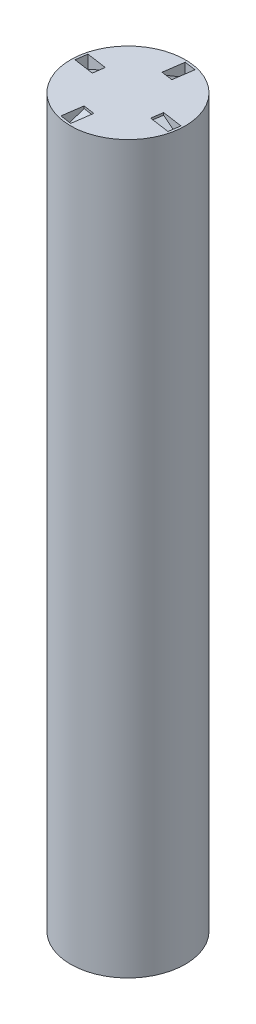
ISO-10303-21;
HEADER;
FILE_DESCRIPTION(('STEP AP214'),'2;1');
FILE_NAME('part.step','',(''),(''),'','','');
FILE_SCHEMA(('AUTOMOTIVE_DESIGN { 1 0 10303 214 1 1 1 1 }'));
ENDSEC;
DATA;
#1=APPLICATION_CONTEXT('core data for automotive mechanical design processes');
#2=APPLICATION_PROTOCOL_DEFINITION('international standard','automotive_design',2000,#1);
#3=PRODUCT_CONTEXT('',#1,'mechanical');
#4=PRODUCT('Part','Part','',(#3));
#5=PRODUCT_RELATED_PRODUCT_CATEGORY('part','',(#4));
#6=PRODUCT_DEFINITION_FORMATION('','',#4);
#7=PRODUCT_DEFINITION_CONTEXT('part definition',#1,'design');
#8=PRODUCT_DEFINITION('design','',#6,#7);
#9=PRODUCT_DEFINITION_SHAPE('','',#8);
#10=(LENGTH_UNIT() NAMED_UNIT(*) SI_UNIT(.MILLI.,.METRE.));
#11=(NAMED_UNIT(*) PLANE_ANGLE_UNIT() SI_UNIT($,.RADIAN.));
#12=(NAMED_UNIT(*) SI_UNIT($,.STERADIAN.) SOLID_ANGLE_UNIT());
#13=UNCERTAINTY_MEASURE_WITH_UNIT(LENGTH_MEASURE(1.E-05),#10,'distance_accuracy_value','');
#14=(GEOMETRIC_REPRESENTATION_CONTEXT(3) GLOBAL_UNCERTAINTY_ASSIGNED_CONTEXT((#13)) GLOBAL_UNIT_ASSIGNED_CONTEXT((#10,
#11,#12)) REPRESENTATION_CONTEXT('',''));
#15=CARTESIAN_POINT('',(0.,0.,0.));
#16=DIRECTION('',(0.,0.,1.));
#17=DIRECTION('',(1.,0.,0.));
#18=AXIS2_PLACEMENT_3D('',#15,#16,#17);
#19=CARTESIAN_POINT('',(0.,80.99,0.));
#20=DIRECTION('',(0.,1.,0.));
#21=DIRECTION('',(0.,0.,1.));
#22=AXIS2_PLACEMENT_3D('',#19,#20,#21);
#23=PLANE('',#22);
#24=DIRECTION('',(0.142609317523363,0.,-0.989779057444398));
#25=VECTOR('',#24,1.);
#26=CARTESIAN_POINT('',(5.96715954111172,80.99,1.50636906135462));
#27=LINE('',#26,#25);
#28=CARTESIAN_POINT('',(5.96715954111172,80.99,1.50636906135462));
#29=VERTEX_POINT('',#28);
#30=CARTESIAN_POINT('',(6.14969946754163,80.99,0.239451867825787));
#31=VERTEX_POINT('',#30);
#32=EDGE_CURVE('E249',#29,#31,#27,.T.);
#33=ORIENTED_EDGE('',*,*,#32,.F.);
#34=DIRECTION('',(0.989779057444398,0.,0.142609317523363));
#35=VECTOR('',#34,1.);
#36=CARTESIAN_POINT('',(3.7104632901385,80.99,1.18121981740135));
#37=LINE('',#36,#35);
#38=CARTESIAN_POINT('',(3.7104632901385,80.99,1.18121981740135));
#39=VERTEX_POINT('',#38);
#40=EDGE_CURVE('E225',#39,#29,#37,.T.);
#41=ORIENTED_EDGE('',*,*,#40,.F.);
#42=DIRECTION('',(0.142609317523363,0.,-0.989779057444398));
#43=VECTOR('',#42,1.);
#44=CARTESIAN_POINT('',(3.7104632901385,80.99,1.18121981740135));
#45=LINE('',#44,#43);
#46=CARTESIAN_POINT('',(3.8930032165684,80.99,-0.0856973761274811));
#47=VERTEX_POINT('',#46);
#48=EDGE_CURVE('E235',#39,#47,#45,.T.);
#49=ORIENTED_EDGE('',*,*,#48,.T.);
#50=DIRECTION('',(0.989779057444398,0.,0.142609317523363));
#51=VECTOR('',#50,1.);
#52=CARTESIAN_POINT('',(3.8930032165684,80.99,-0.0856973761274811));
#53=LINE('',#52,#51);
#54=EDGE_CURVE('E238',#47,#31,#53,.T.);
#55=ORIENTED_EDGE('',*,*,#54,.T.);
#56=EDGE_LOOP('',(#33,#41,#49,#55));
#57=FACE_BOUND('',#56,.T.);
#58=DIRECTION('',(-0.142609317523363,0.,0.989779057444398));
#59=VECTOR('',#58,1.);
#60=CARTESIAN_POINT('',(-5.96715954111172,80.99,-1.50636906135462));
#61=LINE('',#60,#59);
#62=CARTESIAN_POINT('',(-5.96715954111172,80.99,-1.50636906135462));
#63=VERTEX_POINT('',#62);
#64=CARTESIAN_POINT('',(-6.14969946754163,80.99,-0.239451867825787));
#65=VERTEX_POINT('',#64);
#66=EDGE_CURVE('E316',#63,#65,#61,.T.);
#67=ORIENTED_EDGE('',*,*,#66,.F.);
#68=DIRECTION('',(-0.989779057444398,0.,-0.142609317523363));
#69=VECTOR('',#68,1.);
#70=CARTESIAN_POINT('',(-3.7104632901385,80.99,-1.18121981740135));
#71=LINE('',#70,#69);
#72=CARTESIAN_POINT('',(-3.7104632901385,80.99,-1.18121981740135));
#73=VERTEX_POINT('',#72);
#74=EDGE_CURVE('E290',#73,#63,#71,.T.);
#75=ORIENTED_EDGE('',*,*,#74,.F.);
#76=DIRECTION('',(-0.142609317523363,0.,0.989779057444398));
#77=VECTOR('',#76,1.);
#78=CARTESIAN_POINT('',(-3.7104632901385,80.99,-1.18121981740135));
#79=LINE('',#78,#77);
#80=CARTESIAN_POINT('',(-3.8930032165684,80.99,0.0856973761274811));
#81=VERTEX_POINT('',#80);
#82=EDGE_CURVE('E300',#73,#81,#79,.T.);
#83=ORIENTED_EDGE('',*,*,#82,.T.);
#84=DIRECTION('',(-0.989779057444398,0.,-0.142609317523363));
#85=VECTOR('',#84,1.);
#86=CARTESIAN_POINT('',(-3.8930032165684,80.99,0.0856973761274811));
#87=LINE('',#86,#85);
#88=EDGE_CURVE('E303',#81,#65,#87,.T.);
#89=ORIENTED_EDGE('',*,*,#88,.T.);
#90=EDGE_LOOP('',(#67,#75,#83,#89));
#91=FACE_BOUND('',#90,.T.);
#92=CARTESIAN_POINT('',(0.,80.99,0.));
#93=DIRECTION('',(0.,1.,0.));
#94=DIRECTION('',(0.,0.,1.));
#95=AXIS2_PLACEMENT_3D('',#92,#93,#94);
#96=CIRCLE('',#95,6.395);
#97=CARTESIAN_POINT('',(0.,80.99,6.395));
#98=VERTEX_POINT('',#97);
#99=EDGE_CURVE('E11',#98,#98,#96,.T.);
#100=ORIENTED_EDGE('',*,*,#99,.T.);
#101=EDGE_LOOP('',(#100));
#102=FACE_BOUND('',#101,.T.);
#103=DIRECTION('',(0.989779057444398,0.,0.14260931752336));
#104=VECTOR('',#103,1.);
#105=CARTESIAN_POINT('',(-1.5063690613546,80.99,5.96715954111173));
#106=LINE('',#105,#104);
#107=CARTESIAN_POINT('',(-1.5063690613546,80.99,5.96715954111173));
#108=VERTEX_POINT('',#107);
#109=CARTESIAN_POINT('',(-0.239451867825765,80.99,6.14969946754163));
#110=VERTEX_POINT('',#109);
#111=EDGE_CURVE('E282',#108,#110,#106,.T.);
#112=ORIENTED_EDGE('',*,*,#111,.F.);
#113=DIRECTION('',(-0.14260931752336,0.,0.989779057444398));
#114=VECTOR('',#113,1.);
#115=CARTESIAN_POINT('',(-1.18121981740134,80.99,3.7104632901385));
#116=LINE('',#115,#114);
#117=CARTESIAN_POINT('',(-1.18121981740134,80.99,3.7104632901385));
#118=VERTEX_POINT('',#117);
#119=EDGE_CURVE('E256',#118,#108,#116,.T.);
#120=ORIENTED_EDGE('',*,*,#119,.F.);
#121=DIRECTION('',(0.989779057444398,0.,0.14260931752336));
#122=VECTOR('',#121,1.);
#123=CARTESIAN_POINT('',(-1.18121981740134,80.99,3.7104632901385));
#124=LINE('',#123,#122);
#125=CARTESIAN_POINT('',(0.0856973761274947,80.99,3.8930032165684));
#126=VERTEX_POINT('',#125);
#127=EDGE_CURVE('E266',#118,#126,#124,.T.);
#128=ORIENTED_EDGE('',*,*,#127,.T.);
#129=DIRECTION('',(-0.14260931752336,0.,0.989779057444398));
#130=VECTOR('',#129,1.);
#131=CARTESIAN_POINT('',(0.0856973761274947,80.99,3.8930032165684));
#132=LINE('',#131,#130);
#133=EDGE_CURVE('E269',#126,#110,#132,.T.);
#134=ORIENTED_EDGE('',*,*,#133,.T.);
#135=EDGE_LOOP('',(#112,#120,#128,#134));
#136=FACE_BOUND('',#135,.T.);
#137=DIRECTION('',(-0.989779057444399,0.,-0.142609317523353));
#138=VECTOR('',#137,1.);
#139=CARTESIAN_POINT('',(1.50636906135455,80.99,-5.96715954111174));
#140=LINE('',#139,#138);
#141=CARTESIAN_POINT('',(1.50636906135455,80.99,-5.96715954111174));
#142=VERTEX_POINT('',#141);
#143=CARTESIAN_POINT('',(0.239451867825722,80.99,-6.14969946754163));
#144=VERTEX_POINT('',#143);
#145=EDGE_CURVE('E193',#142,#144,#140,.T.);
#146=ORIENTED_EDGE('',*,*,#145,.F.);
#147=DIRECTION('',(0.142609317523353,0.,-0.989779057444399));
#148=VECTOR('',#147,1.);
#149=CARTESIAN_POINT('',(1.18121981740131,80.99,-3.71046329013851));
#150=LINE('',#149,#148);
#151=CARTESIAN_POINT('',(1.18121981740131,80.99,-3.71046329013851));
#152=VERTEX_POINT('',#151);
#153=EDGE_CURVE('E200',#152,#142,#150,.T.);
#154=ORIENTED_EDGE('',*,*,#153,.F.);
#155=DIRECTION('',(-0.989779057444399,0.,-0.142609317523353));
#156=VECTOR('',#155,1.);
#157=CARTESIAN_POINT('',(1.18121981740131,80.99,-3.71046329013851));
#158=LINE('',#157,#156);
#159=CARTESIAN_POINT('',(-0.0856973761275219,80.99,-3.8930032165684));
#160=VERTEX_POINT('',#159);
#161=EDGE_CURVE('E183',#152,#160,#158,.T.);
#162=ORIENTED_EDGE('',*,*,#161,.T.);
#163=DIRECTION('',(0.142609317523353,0.,-0.989779057444399));
#164=VECTOR('',#163,1.);
#165=CARTESIAN_POINT('',(-0.0856973761275219,80.99,-3.8930032165684));
#166=LINE('',#165,#164);
#167=EDGE_CURVE('E211',#160,#144,#166,.T.);
#168=ORIENTED_EDGE('',*,*,#167,.T.);
#169=EDGE_LOOP('',(#146,#154,#162,#168));
#170=FACE_BOUND('',#169,.T.);
#171=ADVANCED_FACE('F43',(#57,#91,#102,#136,#170),#23,.T.);
#172=CARTESIAN_POINT('',(0.,80.99,0.));
#173=DIRECTION('',(0.,-1.,0.));
#174=DIRECTION('',(0.,0.,-1.));
#175=AXIS2_PLACEMENT_3D('',#172,#173,#174);
#176=CYLINDRICAL_SURFACE('',#175,6.395);
#177=ORIENTED_EDGE('',*,*,#99,.F.);
#178=EDGE_LOOP('',(#177));
#179=FACE_BOUND('',#178,.T.);
#180=CARTESIAN_POINT('',(0.,0.,0.));
#181=DIRECTION('',(0.,1.,0.));
#182=DIRECTION('',(0.,0.,1.));
#183=AXIS2_PLACEMENT_3D('',#180,#181,#182);
#184=CIRCLE('',#183,6.395);
#185=CARTESIAN_POINT('',(0.,0.,6.395));
#186=VERTEX_POINT('',#185);
#187=EDGE_CURVE('E47',#186,#186,#184,.T.);
#188=ORIENTED_EDGE('',*,*,#187,.T.);
#189=EDGE_LOOP('',(#188));
#190=FACE_BOUND('',#189,.T.);
#191=ADVANCED_FACE('F45',(#179,#190),#176,.T.);
#192=CARTESIAN_POINT('',(0.,0.,0.));
#193=DIRECTION('',(0.,1.,0.));
#194=DIRECTION('',(0.,0.,1.));
#195=AXIS2_PLACEMENT_3D('',#192,#193,#194);
#196=PLANE('',#195);
#197=DIRECTION('',(-1.,0.,0.));
#198=VECTOR('',#197,1.);
#199=CARTESIAN_POINT('',(-3.07,0.,1.85));
#200=LINE('',#199,#198);
#201=CARTESIAN_POINT('',(3.07,0.,1.85));
#202=VERTEX_POINT('',#201);
#203=CARTESIAN_POINT('',(-3.07,0.,1.85));
#204=VERTEX_POINT('',#203);
#205=EDGE_CURVE('E336',#202,#204,#200,.T.);
#206=ORIENTED_EDGE('',*,*,#205,.F.);
#207=DIRECTION('',(0.,0.,1.));
#208=VECTOR('',#207,1.);
#209=CARTESIAN_POINT('',(3.07,0.,-1.85));
#210=LINE('',#209,#208);
#211=CARTESIAN_POINT('',(3.07,0.,-1.85));
#212=VERTEX_POINT('',#211);
#213=EDGE_CURVE('E313',#212,#202,#210,.T.);
#214=ORIENTED_EDGE('',*,*,#213,.F.);
#215=DIRECTION('',(1.,0.,0.));
#216=VECTOR('',#215,1.);
#217=CARTESIAN_POINT('',(-3.07,0.,-1.85));
#218=LINE('',#217,#216);
#219=CARTESIAN_POINT('',(-3.07,0.,-1.85));
#220=VERTEX_POINT('',#219);
#221=EDGE_CURVE('E325',#220,#212,#218,.T.);
#222=ORIENTED_EDGE('',*,*,#221,.F.);
#223=DIRECTION('',(0.,0.,-1.));
#224=VECTOR('',#223,1.);
#225=CARTESIAN_POINT('',(-3.07,0.,-1.85));
#226=LINE('',#225,#224);
#227=EDGE_CURVE('E339',#204,#220,#226,.T.);
#228=ORIENTED_EDGE('',*,*,#227,.F.);
#229=EDGE_LOOP('',(#206,#214,#222,#228));
#230=FACE_BOUND('',#229,.T.);
#231=ORIENTED_EDGE('',*,*,#187,.F.);
#232=EDGE_LOOP('',(#231));
#233=FACE_BOUND('',#232,.T.);
#234=ADVANCED_FACE('F360',(#230,#233),#196,.F.);
#235=CARTESIAN_POINT('',(3.07,8.5,-1.85));
#236=DIRECTION('',(1.,0.,0.));
#237=DIRECTION('',(0.,0.,-1.));
#238=AXIS2_PLACEMENT_3D('',#235,#236,#237);
#239=PLANE('',#238);
#240=ORIENTED_EDGE('',*,*,#213,.T.);
#241=DIRECTION('',(0.,-1.,0.));
#242=VECTOR('',#241,1.);
#243=CARTESIAN_POINT('',(3.07,8.5,1.85));
#244=LINE('',#243,#242);
#245=CARTESIAN_POINT('',(3.07,8.5,1.85));
#246=VERTEX_POINT('',#245);
#247=EDGE_CURVE('E334',#246,#202,#244,.T.);
#248=ORIENTED_EDGE('',*,*,#247,.F.);
#249=DIRECTION('',(0.,0.,1.));
#250=VECTOR('',#249,1.);
#251=CARTESIAN_POINT('',(3.07,8.5,-1.85));
#252=LINE('',#251,#250);
#253=CARTESIAN_POINT('',(3.07,8.5,-1.85));
#254=VERTEX_POINT('',#253);
#255=EDGE_CURVE('E321',#254,#246,#252,.T.);
#256=ORIENTED_EDGE('',*,*,#255,.F.);
#257=DIRECTION('',(0.,-1.,0.));
#258=VECTOR('',#257,1.);
#259=CARTESIAN_POINT('',(3.07,8.5,-1.85));
#260=LINE('',#259,#258);
#261=EDGE_CURVE('E344',#254,#212,#260,.T.);
#262=ORIENTED_EDGE('',*,*,#261,.T.);
#263=EDGE_LOOP('',(#240,#248,#256,#262));
#264=FACE_BOUND('',#263,.T.);
#265=ADVANCED_FACE('F369',(#264),#239,.F.);
#266=CARTESIAN_POINT('',(-3.07,8.5,-1.85));
#267=DIRECTION('',(0.,0.,-1.));
#268=DIRECTION('',(-1.,0.,0.));
#269=AXIS2_PLACEMENT_3D('',#266,#267,#268);
#270=PLANE('',#269);
#271=ORIENTED_EDGE('',*,*,#221,.T.);
#272=ORIENTED_EDGE('',*,*,#261,.F.);
#273=DIRECTION('',(1.,0.,0.));
#274=VECTOR('',#273,1.);
#275=CARTESIAN_POINT('',(-3.07,8.5,-1.85));
#276=LINE('',#275,#274);
#277=CARTESIAN_POINT('',(-3.07,8.5,-1.85));
#278=VERTEX_POINT('',#277);
#279=EDGE_CURVE('E331',#278,#254,#276,.T.);
#280=ORIENTED_EDGE('',*,*,#279,.F.);
#281=DIRECTION('',(0.,-1.,0.));
#282=VECTOR('',#281,1.);
#283=CARTESIAN_POINT('',(-3.07,8.5,-1.85));
#284=LINE('',#283,#282);
#285=EDGE_CURVE('E346',#278,#220,#284,.T.);
#286=ORIENTED_EDGE('',*,*,#285,.T.);
#287=EDGE_LOOP('',(#271,#272,#280,#286));
#288=FACE_BOUND('',#287,.T.);
#289=ADVANCED_FACE('F371',(#288),#270,.F.);
#290=CARTESIAN_POINT('',(-3.07,8.5,-1.85));
#291=DIRECTION('',(-1.,0.,0.));
#292=DIRECTION('',(0.,0.,1.));
#293=AXIS2_PLACEMENT_3D('',#290,#291,#292);
#294=PLANE('',#293);
#295=ORIENTED_EDGE('',*,*,#227,.T.);
#296=ORIENTED_EDGE('',*,*,#285,.F.);
#297=DIRECTION('',(0.,0.,-1.));
#298=VECTOR('',#297,1.);
#299=CARTESIAN_POINT('',(-3.07,8.5,-1.85));
#300=LINE('',#299,#298);
#301=CARTESIAN_POINT('',(-3.07,8.5,1.85));
#302=VERTEX_POINT('',#301);
#303=EDGE_CURVE('E328',#302,#278,#300,.T.);
#304=ORIENTED_EDGE('',*,*,#303,.F.);
#305=DIRECTION('',(0.,-1.,0.));
#306=VECTOR('',#305,1.);
#307=CARTESIAN_POINT('',(-3.07,8.5,1.85));
#308=LINE('',#307,#306);
#309=EDGE_CURVE('E348',#302,#204,#308,.T.);
#310=ORIENTED_EDGE('',*,*,#309,.T.);
#311=EDGE_LOOP('',(#295,#296,#304,#310));
#312=FACE_BOUND('',#311,.T.);
#313=ADVANCED_FACE('F364',(#312),#294,.F.);
#314=CARTESIAN_POINT('',(-3.07,8.5,1.85));
#315=DIRECTION('',(0.,0.,1.));
#316=DIRECTION('',(1.,0.,0.));
#317=AXIS2_PLACEMENT_3D('',#314,#315,#316);
#318=PLANE('',#317);
#319=ORIENTED_EDGE('',*,*,#205,.T.);
#320=ORIENTED_EDGE('',*,*,#309,.F.);
#321=DIRECTION('',(-1.,0.,0.));
#322=VECTOR('',#321,1.);
#323=CARTESIAN_POINT('',(-3.07,8.5,1.85));
#324=LINE('',#323,#322);
#325=EDGE_CURVE('E324',#246,#302,#324,.T.);
#326=ORIENTED_EDGE('',*,*,#325,.F.);
#327=ORIENTED_EDGE('',*,*,#247,.T.);
#328=EDGE_LOOP('',(#319,#320,#326,#327));
#329=FACE_BOUND('',#328,.T.);
#330=ADVANCED_FACE('F354',(#329),#318,.F.);
#331=CARTESIAN_POINT('',(0.,8.5,0.));
#332=DIRECTION('',(0.,1.,0.));
#333=DIRECTION('',(0.,0.,1.));
#334=AXIS2_PLACEMENT_3D('',#331,#332,#333);
#335=PLANE('',#334);
#336=ORIENTED_EDGE('',*,*,#255,.T.);
#337=ORIENTED_EDGE('',*,*,#325,.T.);
#338=ORIENTED_EDGE('',*,*,#303,.T.);
#339=ORIENTED_EDGE('',*,*,#279,.T.);
#340=EDGE_LOOP('',(#336,#337,#338,#339));
#341=FACE_BOUND('',#340,.T.);
#342=ADVANCED_FACE('F368',(#341),#335,.F.);
#343=CARTESIAN_POINT('',(-3.7104632901385,80.7336630059735,-1.18121981740135));
#344=DIRECTION('',(0.989779057444398,0.,0.142609317523363));
#345=DIRECTION('',(0.142609317523363,0.,-0.989779057444398));
#346=AXIS2_PLACEMENT_3D('',#343,#344,#345);
#347=PLANE('',#346);
#348=DIRECTION('',(0.,1.,0.));
#349=VECTOR('',#348,1.);
#350=CARTESIAN_POINT('',(-3.8930032165684,80.7336630059735,0.0856973761274811));
#351=LINE('',#350,#349);
#352=CARTESIAN_POINT('',(-3.8930032165684,80.7336630059735,0.0856973761274811));
#353=VERTEX_POINT('',#352);
#354=EDGE_CURVE('E279',#353,#81,#351,.T.);
#355=ORIENTED_EDGE('',*,*,#354,.T.);
#356=ORIENTED_EDGE('',*,*,#82,.F.);
#357=DIRECTION('',(0.,1.,0.));
#358=VECTOR('',#357,1.);
#359=CARTESIAN_POINT('',(-3.7104632901385,80.7336630059735,-1.18121981740135));
#360=LINE('',#359,#358);
#361=CARTESIAN_POINT('',(-3.7104632901385,80.7336630059735,-1.18121981740135));
#362=VERTEX_POINT('',#361);
#363=EDGE_CURVE('E287',#362,#73,#360,.T.);
#364=ORIENTED_EDGE('',*,*,#363,.F.);
#365=DIRECTION('',(-0.142609317523363,0.,0.989779057444398));
#366=VECTOR('',#365,1.);
#367=CARTESIAN_POINT('',(-3.7104632901385,80.7336630059735,-1.18121981740135));
#368=LINE('',#367,#366);
#369=EDGE_CURVE('E311',#362,#353,#368,.T.);
#370=ORIENTED_EDGE('',*,*,#369,.T.);
#371=EDGE_LOOP('',(#355,#356,#364,#370));
#372=FACE_BOUND('',#371,.T.);
#373=ADVANCED_FACE('F540',(#372),#347,.F.);
#374=CARTESIAN_POINT('',(-5.96715954111172,79.5136630059735,-1.50636906135462));
#375=DIRECTION('',(0.466969939279062,-0.881709824778179,0.0672819492831657));
#376=DIRECTION('',(0.883712314871031,0.468030495315512,0.));
#377=AXIS2_PLACEMENT_3D('',#374,#375,#376);
#378=PLANE('',#377);
#379=DIRECTION('',(0.872697919308411,0.471792099223411,0.12574003636526));
#380=VECTOR('',#379,1.);
#381=CARTESIAN_POINT('',(-6.14969946754163,79.5136630059735,-0.239451867825787));
#382=LINE('',#381,#380);
#383=CARTESIAN_POINT('',(-6.14969946754163,79.5136630059735,-0.239451867825787));
#384=VERTEX_POINT('',#383);
#385=EDGE_CURVE('E291',#384,#353,#382,.T.);
#386=ORIENTED_EDGE('',*,*,#385,.T.);
#387=ORIENTED_EDGE('',*,*,#369,.F.);
#388=DIRECTION('',(0.872697919308411,0.471792099223411,0.12574003636526));
#389=VECTOR('',#388,1.);
#390=CARTESIAN_POINT('',(-5.96715954111172,79.5136630059735,-1.50636906135462));
#391=LINE('',#390,#389);
#392=CARTESIAN_POINT('',(-5.96715954111172,79.5136630059735,-1.50636906135462));
#393=VERTEX_POINT('',#392);
#394=EDGE_CURVE('E297',#393,#362,#391,.T.);
#395=ORIENTED_EDGE('',*,*,#394,.F.);
#396=DIRECTION('',(-0.142609317523363,0.,0.989779057444398));
#397=VECTOR('',#396,1.);
#398=CARTESIAN_POINT('',(-5.96715954111172,79.5136630059735,-1.50636906135462));
#399=LINE('',#398,#397);
#400=EDGE_CURVE('E314',#393,#384,#399,.T.);
#401=ORIENTED_EDGE('',*,*,#400,.T.);
#402=EDGE_LOOP('',(#386,#387,#395,#401));
#403=FACE_BOUND('',#402,.T.);
#404=ADVANCED_FACE('F537',(#403),#378,.F.);
#405=CARTESIAN_POINT('',(-5.96715954111172,80.99,-1.50636906135462));
#406=DIRECTION('',(-0.989779057444398,0.,-0.142609317523363));
#407=DIRECTION('',(-0.142609317523363,0.,0.989779057444398));
#408=AXIS2_PLACEMENT_3D('',#405,#406,#407);
#409=PLANE('',#408);
#410=DIRECTION('',(0.,-1.,0.));
#411=VECTOR('',#410,1.);
#412=CARTESIAN_POINT('',(-6.14969946754163,80.99,-0.239451867825787));
#413=LINE('',#412,#411);
#414=EDGE_CURVE('E306',#65,#384,#413,.T.);
#415=ORIENTED_EDGE('',*,*,#414,.T.);
#416=ORIENTED_EDGE('',*,*,#400,.F.);
#417=DIRECTION('',(0.,-1.,0.));
#418=VECTOR('',#417,1.);
#419=CARTESIAN_POINT('',(-5.96715954111172,80.99,-1.50636906135462));
#420=LINE('',#419,#418);
#421=EDGE_CURVE('E294',#63,#393,#420,.T.);
#422=ORIENTED_EDGE('',*,*,#421,.F.);
#423=ORIENTED_EDGE('',*,*,#66,.T.);
#424=EDGE_LOOP('',(#415,#416,#422,#423));
#425=FACE_BOUND('',#424,.T.);
#426=ADVANCED_FACE('F533',(#425),#409,.F.);
#427=CARTESIAN_POINT('',(0.091269963214956,0.,-0.633458596764439));
#428=DIRECTION('',(-0.142609317523363,0.,0.989779057444398));
#429=DIRECTION('',(0.989779057444398,0.,0.142609317523363));
#430=AXIS2_PLACEMENT_3D('',#427,#428,#429);
#431=PLANE('',#430);
#432=ORIENTED_EDGE('',*,*,#363,.T.);
#433=ORIENTED_EDGE('',*,*,#74,.T.);
#434=ORIENTED_EDGE('',*,*,#421,.T.);
#435=ORIENTED_EDGE('',*,*,#394,.T.);
#436=EDGE_LOOP('',(#432,#433,#434,#435));
#437=FACE_BOUND('',#436,.T.);
#438=ADVANCED_FACE('F531',(#437),#431,.T.);
#439=CARTESIAN_POINT('',(-0.091269963214949,0.,0.63345859676439));
#440=DIRECTION('',(-0.142609317523363,0.,0.989779057444398));
#441=DIRECTION('',(0.989779057444398,0.,0.142609317523363));
#442=AXIS2_PLACEMENT_3D('',#439,#440,#441);
#443=PLANE('',#442);
#444=ORIENTED_EDGE('',*,*,#354,.F.);
#445=ORIENTED_EDGE('',*,*,#385,.F.);
#446=ORIENTED_EDGE('',*,*,#414,.F.);
#447=ORIENTED_EDGE('',*,*,#88,.F.);
#448=EDGE_LOOP('',(#444,#445,#446,#447));
#449=FACE_BOUND('',#448,.T.);
#450=ADVANCED_FACE('F415',(#449),#443,.F.);
#451=CARTESIAN_POINT('',(-1.18121981740134,80.7336630059735,3.7104632901385));
#452=DIRECTION('',(0.14260931752336,0.,-0.989779057444398));
#453=DIRECTION('',(-0.989779057444398,0.,-0.14260931752336));
#454=AXIS2_PLACEMENT_3D('',#451,#452,#453);
#455=PLANE('',#454);
#456=DIRECTION('',(0.,1.,0.));
#457=VECTOR('',#456,1.);
#458=CARTESIAN_POINT('',(0.0856973761274947,80.7336630059735,3.8930032165684));
#459=LINE('',#458,#457);
#460=CARTESIAN_POINT('',(0.0856973761274947,80.7336630059735,3.8930032165684));
#461=VERTEX_POINT('',#460);
#462=EDGE_CURVE('E246',#461,#126,#459,.T.);
#463=ORIENTED_EDGE('',*,*,#462,.T.);
#464=ORIENTED_EDGE('',*,*,#127,.F.);
#465=DIRECTION('',(0.,1.,0.));
#466=VECTOR('',#465,1.);
#467=CARTESIAN_POINT('',(-1.18121981740134,80.7336630059735,3.7104632901385));
#468=LINE('',#467,#466);
#469=CARTESIAN_POINT('',(-1.18121981740134,80.7336630059735,3.7104632901385));
#470=VERTEX_POINT('',#469);
#471=EDGE_CURVE('E253',#470,#118,#468,.T.);
#472=ORIENTED_EDGE('',*,*,#471,.F.);
#473=DIRECTION('',(0.989779057444398,0.,0.14260931752336));
#474=VECTOR('',#473,1.);
#475=CARTESIAN_POINT('',(-1.18121981740134,80.7336630059735,3.7104632901385));
#476=LINE('',#475,#474);
#477=EDGE_CURVE('E277',#470,#461,#476,.T.);
#478=ORIENTED_EDGE('',*,*,#477,.T.);
#479=EDGE_LOOP('',(#463,#464,#472,#478));
#480=FACE_BOUND('',#479,.T.);
#481=ADVANCED_FACE('F418',(#480),#455,.F.);
#482=CARTESIAN_POINT('',(-1.5063690613546,79.5136630059735,5.96715954111173));
#483=DIRECTION('',(0.0672819492831641,-0.881709824778179,-0.466969939279062));
#484=DIRECTION('',(0.,0.468030495315513,-0.883712314871031));
#485=AXIS2_PLACEMENT_3D('',#482,#483,#484);
#486=PLANE('',#485);
#487=DIRECTION('',(0.125740036365257,0.471792099223411,-0.872697919308411));
#488=VECTOR('',#487,1.);
#489=CARTESIAN_POINT('',(-0.239451867825765,79.5136630059735,6.14969946754163));
#490=LINE('',#489,#488);
#491=CARTESIAN_POINT('',(-0.239451867825765,79.5136630059735,6.14969946754163));
#492=VERTEX_POINT('',#491);
#493=EDGE_CURVE('E257',#492,#461,#490,.T.);
#494=ORIENTED_EDGE('',*,*,#493,.T.);
#495=ORIENTED_EDGE('',*,*,#477,.F.);
#496=DIRECTION('',(0.125740036365257,0.471792099223411,-0.872697919308411));
#497=VECTOR('',#496,1.);
#498=CARTESIAN_POINT('',(-1.5063690613546,79.5136630059735,5.96715954111173));
#499=LINE('',#498,#497);
#500=CARTESIAN_POINT('',(-1.5063690613546,79.5136630059735,5.96715954111173));
#501=VERTEX_POINT('',#500);
#502=EDGE_CURVE('E263',#501,#470,#499,.T.);
#503=ORIENTED_EDGE('',*,*,#502,.F.);
#504=DIRECTION('',(0.989779057444398,0.,0.14260931752336));
#505=VECTOR('',#504,1.);
#506=CARTESIAN_POINT('',(-1.5063690613546,79.5136630059735,5.96715954111173));
#507=LINE('',#506,#505);
#508=EDGE_CURVE('E280',#501,#492,#507,.T.);
#509=ORIENTED_EDGE('',*,*,#508,.T.);
#510=EDGE_LOOP('',(#494,#495,#503,#509));
#511=FACE_BOUND('',#510,.T.);
#512=ADVANCED_FACE('F421',(#511),#486,.F.);
#513=CARTESIAN_POINT('',(-1.5063690613546,80.99,5.96715954111173));
#514=DIRECTION('',(-0.14260931752336,0.,0.989779057444398));
#515=DIRECTION('',(0.989779057444398,0.,0.14260931752336));
#516=AXIS2_PLACEMENT_3D('',#513,#514,#515);
#517=PLANE('',#516);
#518=DIRECTION('',(0.,-1.,0.));
#519=VECTOR('',#518,1.);
#520=CARTESIAN_POINT('',(-0.239451867825765,80.99,6.14969946754163));
#521=LINE('',#520,#519);
#522=EDGE_CURVE('E272',#110,#492,#521,.T.);
#523=ORIENTED_EDGE('',*,*,#522,.T.);
#524=ORIENTED_EDGE('',*,*,#508,.F.);
#525=DIRECTION('',(0.,-1.,0.));
#526=VECTOR('',#525,1.);
#527=CARTESIAN_POINT('',(-1.5063690613546,80.99,5.96715954111173));
#528=LINE('',#527,#526);
#529=EDGE_CURVE('E260',#108,#501,#528,.T.);
#530=ORIENTED_EDGE('',*,*,#529,.F.);
#531=ORIENTED_EDGE('',*,*,#111,.T.);
#532=EDGE_LOOP('',(#523,#524,#530,#531));
#533=FACE_BOUND('',#532,.T.);
#534=ADVANCED_FACE('F429',(#533),#517,.F.);
#535=CARTESIAN_POINT('',(-0.63345859676444,0.,-0.0912699632149538));
#536=DIRECTION('',(0.989779057444398,0.,0.14260931752336));
#537=DIRECTION('',(0.14260931752336,0.,-0.989779057444398));
#538=AXIS2_PLACEMENT_3D('',#535,#536,#537);
#539=PLANE('',#538);
#540=ORIENTED_EDGE('',*,*,#471,.T.);
#541=ORIENTED_EDGE('',*,*,#119,.T.);
#542=ORIENTED_EDGE('',*,*,#529,.T.);
#543=ORIENTED_EDGE('',*,*,#502,.T.);
#544=EDGE_LOOP('',(#540,#541,#542,#543));
#545=FACE_BOUND('',#544,.T.);
#546=ADVANCED_FACE('F437',(#545),#539,.T.);
#547=CARTESIAN_POINT('',(0.63345859676439,0.,0.0912699632149468));
#548=DIRECTION('',(0.989779057444398,0.,0.14260931752336));
#549=DIRECTION('',(0.14260931752336,0.,-0.989779057444398));
#550=AXIS2_PLACEMENT_3D('',#547,#548,#549);
#551=PLANE('',#550);
#552=ORIENTED_EDGE('',*,*,#462,.F.);
#553=ORIENTED_EDGE('',*,*,#493,.F.);
#554=ORIENTED_EDGE('',*,*,#522,.F.);
#555=ORIENTED_EDGE('',*,*,#133,.F.);
#556=EDGE_LOOP('',(#552,#553,#554,#555));
#557=FACE_BOUND('',#556,.T.);
#558=ADVANCED_FACE('F445',(#557),#551,.F.);
#559=CARTESIAN_POINT('',(3.7104632901385,80.7336630059735,1.18121981740135));
#560=DIRECTION('',(-0.989779057444398,0.,-0.142609317523363));
#561=DIRECTION('',(-0.142609317523363,0.,0.989779057444398));
#562=AXIS2_PLACEMENT_3D('',#559,#560,#561);
#563=PLANE('',#562);
#564=DIRECTION('',(0.,1.,0.));
#565=VECTOR('',#564,1.);
#566=CARTESIAN_POINT('',(3.8930032165684,80.7336630059735,-0.0856973761274811));
#567=LINE('',#566,#565);
#568=CARTESIAN_POINT('',(3.8930032165684,80.7336630059735,-0.0856973761274811));
#569=VERTEX_POINT('',#568);
#570=EDGE_CURVE('E218',#569,#47,#567,.T.);
#571=ORIENTED_EDGE('',*,*,#570,.T.);
#572=ORIENTED_EDGE('',*,*,#48,.F.);
#573=DIRECTION('',(0.,1.,0.));
#574=VECTOR('',#573,1.);
#575=CARTESIAN_POINT('',(3.7104632901385,80.7336630059735,1.18121981740135));
#576=LINE('',#575,#574);
#577=CARTESIAN_POINT('',(3.7104632901385,80.7336630059735,1.18121981740135));
#578=VERTEX_POINT('',#577);
#579=EDGE_CURVE('E222',#578,#39,#576,.T.);
#580=ORIENTED_EDGE('',*,*,#579,.F.);
#581=DIRECTION('',(0.142609317523363,0.,-0.989779057444398));
#582=VECTOR('',#581,1.);
#583=CARTESIAN_POINT('',(3.7104632901385,80.7336630059735,1.18121981740135));
#584=LINE('',#583,#582);
#585=EDGE_CURVE('E244',#578,#569,#584,.T.);
#586=ORIENTED_EDGE('',*,*,#585,.T.);
#587=EDGE_LOOP('',(#571,#572,#580,#586));
#588=FACE_BOUND('',#587,.T.);
#589=ADVANCED_FACE('F453',(#588),#563,.F.);
#590=CARTESIAN_POINT('',(5.96715954111172,79.5136630059735,1.50636906135462));
#591=DIRECTION('',(-0.466969939279062,-0.881709824778179,-0.0672819492831657));
#592=DIRECTION('',(0.883712314871031,-0.468030495315512,0.));
#593=AXIS2_PLACEMENT_3D('',#590,#591,#592);
#594=PLANE('',#593);
#595=DIRECTION('',(-0.872697919308411,0.471792099223411,-0.12574003636526));
#596=VECTOR('',#595,1.);
#597=CARTESIAN_POINT('',(6.14969946754163,79.5136630059735,0.239451867825787));
#598=LINE('',#597,#596);
#599=CARTESIAN_POINT('',(6.14969946754163,79.5136630059735,0.239451867825787));
#600=VERTEX_POINT('',#599);
#601=EDGE_CURVE('E226',#600,#569,#598,.T.);
#602=ORIENTED_EDGE('',*,*,#601,.T.);
#603=ORIENTED_EDGE('',*,*,#585,.F.);
#604=DIRECTION('',(-0.872697919308411,0.471792099223411,-0.12574003636526));
#605=VECTOR('',#604,1.);
#606=CARTESIAN_POINT('',(5.96715954111172,79.5136630059735,1.50636906135462));
#607=LINE('',#606,#605);
#608=CARTESIAN_POINT('',(5.96715954111172,79.5136630059735,1.50636906135462));
#609=VERTEX_POINT('',#608);
#610=EDGE_CURVE('E232',#609,#578,#607,.T.);
#611=ORIENTED_EDGE('',*,*,#610,.F.);
#612=DIRECTION('',(0.142609317523363,0.,-0.989779057444398));
#613=VECTOR('',#612,1.);
#614=CARTESIAN_POINT('',(5.96715954111172,79.5136630059735,1.50636906135462));
#615=LINE('',#614,#613);
#616=EDGE_CURVE('E247',#609,#600,#615,.T.);
#617=ORIENTED_EDGE('',*,*,#616,.T.);
#618=EDGE_LOOP('',(#602,#603,#611,#617));
#619=FACE_BOUND('',#618,.T.);
#620=ADVANCED_FACE('F461',(#619),#594,.F.);
#621=CARTESIAN_POINT('',(5.96715954111172,80.99,1.50636906135462));
#622=DIRECTION('',(0.989779057444398,0.,0.142609317523363));
#623=DIRECTION('',(0.142609317523363,0.,-0.989779057444398));
#624=AXIS2_PLACEMENT_3D('',#621,#622,#623);
#625=PLANE('',#624);
#626=DIRECTION('',(0.,-1.,0.));
#627=VECTOR('',#626,1.);
#628=CARTESIAN_POINT('',(6.14969946754163,80.99,0.239451867825787));
#629=LINE('',#628,#627);
#630=EDGE_CURVE('E66',#31,#600,#629,.T.);
#631=ORIENTED_EDGE('',*,*,#630,.T.);
#632=ORIENTED_EDGE('',*,*,#616,.F.);
#633=DIRECTION('',(0.,-1.,0.));
#634=VECTOR('',#633,1.);
#635=CARTESIAN_POINT('',(5.96715954111172,80.99,1.50636906135462));
#636=LINE('',#635,#634);
#637=EDGE_CURVE('E229',#29,#609,#636,.T.);
#638=ORIENTED_EDGE('',*,*,#637,.F.);
#639=ORIENTED_EDGE('',*,*,#32,.T.);
#640=EDGE_LOOP('',(#631,#632,#638,#639));
#641=FACE_BOUND('',#640,.T.);
#642=ADVANCED_FACE('F469',(#641),#625,.F.);
#643=CARTESIAN_POINT('',(-0.091269963214956,0.,0.633458596764439));
#644=DIRECTION('',(0.142609317523363,0.,-0.989779057444398));
#645=DIRECTION('',(-0.989779057444398,0.,-0.142609317523363));
#646=AXIS2_PLACEMENT_3D('',#643,#644,#645);
#647=PLANE('',#646);
#648=ORIENTED_EDGE('',*,*,#579,.T.);
#649=ORIENTED_EDGE('',*,*,#40,.T.);
#650=ORIENTED_EDGE('',*,*,#637,.T.);
#651=ORIENTED_EDGE('',*,*,#610,.T.);
#652=EDGE_LOOP('',(#648,#649,#650,#651));
#653=FACE_BOUND('',#652,.T.);
#654=ADVANCED_FACE('F477',(#653),#647,.T.);
#655=CARTESIAN_POINT('',(0.091269963214949,0.,-0.63345859676439));
#656=DIRECTION('',(0.142609317523363,0.,-0.989779057444398));
#657=DIRECTION('',(-0.989779057444398,0.,-0.142609317523363));
#658=AXIS2_PLACEMENT_3D('',#655,#656,#657);
#659=PLANE('',#658);
#660=ORIENTED_EDGE('',*,*,#570,.F.);
#661=ORIENTED_EDGE('',*,*,#601,.F.);
#662=ORIENTED_EDGE('',*,*,#630,.F.);
#663=ORIENTED_EDGE('',*,*,#54,.F.);
#664=EDGE_LOOP('',(#660,#661,#662,#663));
#665=FACE_BOUND('',#664,.T.);
#666=ADVANCED_FACE('F485',(#665),#659,.F.);
#667=CARTESIAN_POINT('',(1.18121981740131,80.7336630059735,-3.71046329013851));
#668=DIRECTION('',(-0.142609317523353,0.,0.989779057444399));
#669=DIRECTION('',(0.989779057444399,0.,0.142609317523353));
#670=AXIS2_PLACEMENT_3D('',#667,#668,#669);
#671=PLANE('',#670);
#672=DIRECTION('',(0.,1.,0.));
#673=VECTOR('',#672,1.);
#674=CARTESIAN_POINT('',(-0.0856973761275219,80.7336630059735,-3.8930032165684));
#675=LINE('',#674,#673);
#676=CARTESIAN_POINT('',(-0.0856973761275219,80.7336630059735,-3.8930032165684));
#677=VERTEX_POINT('',#676);
#678=EDGE_CURVE('E189',#677,#160,#675,.T.);
#679=ORIENTED_EDGE('',*,*,#678,.T.);
#680=ORIENTED_EDGE('',*,*,#161,.F.);
#681=DIRECTION('',(0.,1.,0.));
#682=VECTOR('',#681,1.);
#683=CARTESIAN_POINT('',(1.18121981740131,80.7336630059735,-3.71046329013851));
#684=LINE('',#683,#682);
#685=CARTESIAN_POINT('',(1.18121981740131,80.7336630059735,-3.71046329013851));
#686=VERTEX_POINT('',#685);
#687=EDGE_CURVE('E186',#686,#152,#684,.T.);
#688=ORIENTED_EDGE('',*,*,#687,.F.);
#689=DIRECTION('',(-0.989779057444399,0.,-0.142609317523353));
#690=VECTOR('',#689,1.);
#691=CARTESIAN_POINT('',(1.18121981740131,80.7336630059735,-3.71046329013851));
#692=LINE('',#691,#690);
#693=EDGE_CURVE('E216',#686,#677,#692,.T.);
#694=ORIENTED_EDGE('',*,*,#693,.T.);
#695=EDGE_LOOP('',(#679,#680,#688,#694));
#696=FACE_BOUND('',#695,.T.);
#697=ADVANCED_FACE('F185',(#696),#671,.F.);
#698=CARTESIAN_POINT('',(1.50636906135455,79.5136630059735,-5.96715954111174));
#699=DIRECTION('',(-0.0672819492831608,-0.881709824778179,0.466969939279063));
#700=DIRECTION('',(0.,-0.468030495315513,-0.883712314871031));
#701=AXIS2_PLACEMENT_3D('',#698,#699,#700);
#702=PLANE('',#701);
#703=DIRECTION('',(-0.125740036365251,0.471792099223411,0.872697919308412));
#704=VECTOR('',#703,1.);
#705=CARTESIAN_POINT('',(0.239451867825722,79.5136630059735,-6.14969946754163));
#706=LINE('',#705,#704);
#707=CARTESIAN_POINT('',(0.239451867825722,79.5136630059735,-6.14969946754163));
#708=VERTEX_POINT('',#707);
#709=EDGE_CURVE('E203',#708,#677,#706,.T.);
#710=ORIENTED_EDGE('',*,*,#709,.T.);
#711=ORIENTED_EDGE('',*,*,#693,.F.);
#712=DIRECTION('',(-0.125740036365251,0.471792099223411,0.872697919308412));
#713=VECTOR('',#712,1.);
#714=CARTESIAN_POINT('',(1.50636906135455,79.5136630059735,-5.96715954111174));
#715=LINE('',#714,#713);
#716=CARTESIAN_POINT('',(1.50636906135455,79.5136630059735,-5.96715954111174));
#717=VERTEX_POINT('',#716);
#718=EDGE_CURVE('E194',#717,#686,#715,.T.);
#719=ORIENTED_EDGE('',*,*,#718,.F.);
#720=DIRECTION('',(-0.989779057444399,0.,-0.142609317523353));
#721=VECTOR('',#720,1.);
#722=CARTESIAN_POINT('',(1.50636906135455,79.5136630059735,-5.96715954111174));
#723=LINE('',#722,#721);
#724=EDGE_CURVE('E219',#717,#708,#723,.T.);
#725=ORIENTED_EDGE('',*,*,#724,.T.);
#726=EDGE_LOOP('',(#710,#711,#719,#725));
#727=FACE_BOUND('',#726,.T.);
#728=ADVANCED_FACE('F499',(#727),#702,.F.);
#729=CARTESIAN_POINT('',(1.50636906135455,80.99,-5.96715954111174));
#730=DIRECTION('',(0.142609317523353,0.,-0.989779057444399));
#731=DIRECTION('',(-0.989779057444399,0.,-0.142609317523353));
#732=AXIS2_PLACEMENT_3D('',#729,#730,#731);
#733=PLANE('',#732);
#734=DIRECTION('',(0.,-1.,0.));
#735=VECTOR('',#734,1.);
#736=CARTESIAN_POINT('',(0.239451867825723,80.99,-6.14969946754163));
#737=LINE('',#736,#735);
#738=EDGE_CURVE('E58',#144,#708,#737,.T.);
#739=ORIENTED_EDGE('',*,*,#738,.T.);
#740=ORIENTED_EDGE('',*,*,#724,.F.);
#741=DIRECTION('',(0.,-1.,0.));
#742=VECTOR('',#741,1.);
#743=CARTESIAN_POINT('',(1.50636906135455,80.99,-5.96715954111174));
#744=LINE('',#743,#742);
#745=EDGE_CURVE('E205',#142,#717,#744,.T.);
#746=ORIENTED_EDGE('',*,*,#745,.F.);
#747=ORIENTED_EDGE('',*,*,#145,.T.);
#748=EDGE_LOOP('',(#739,#740,#746,#747));
#749=FACE_BOUND('',#748,.T.);
#750=ADVANCED_FACE('F506',(#749),#733,.F.);
#751=CARTESIAN_POINT('',(0.63345859676444,0.,0.0912699632149494));
#752=DIRECTION('',(-0.989779057444399,0.,-0.142609317523353));
#753=DIRECTION('',(-0.142609317523353,0.,0.989779057444399));
#754=AXIS2_PLACEMENT_3D('',#751,#752,#753);
#755=PLANE('',#754);
#756=ORIENTED_EDGE('',*,*,#687,.T.);
#757=ORIENTED_EDGE('',*,*,#153,.T.);
#758=ORIENTED_EDGE('',*,*,#745,.T.);
#759=ORIENTED_EDGE('',*,*,#718,.T.);
#760=EDGE_LOOP('',(#756,#757,#758,#759));
#761=FACE_BOUND('',#760,.T.);
#762=ADVANCED_FACE('F198',(#761),#755,.T.);
#763=CARTESIAN_POINT('',(-0.633458596764391,0.,-0.0912699632149423));
#764=DIRECTION('',(-0.989779057444399,0.,-0.142609317523353));
#765=DIRECTION('',(-0.142609317523353,0.,0.989779057444399));
#766=AXIS2_PLACEMENT_3D('',#763,#764,#765);
#767=PLANE('',#766);
#768=ORIENTED_EDGE('',*,*,#678,.F.);
#769=ORIENTED_EDGE('',*,*,#709,.F.);
#770=ORIENTED_EDGE('',*,*,#738,.F.);
#771=ORIENTED_EDGE('',*,*,#167,.F.);
#772=EDGE_LOOP('',(#768,#769,#770,#771));
#773=FACE_BOUND('',#772,.T.);
#774=ADVANCED_FACE('F521',(#773),#767,.F.);
#775=CLOSED_SHELL('',(#171,#191,#234,#265,#289,#313,#330,#342,#373,#404,#426,#438,#450,#481,
#512,#534,#546,#558,#589,#620,#642,#654,#666,#697,#728,#750,#762,#774));
#776=MANIFOLD_SOLID_BREP('B2',#775);
#777=ADVANCED_BREP_SHAPE_REPRESENTATION('',(#18,#776),#14);
#778=SHAPE_DEFINITION_REPRESENTATION(#9,#777);
ENDSEC;
END-ISO-10303-21;
